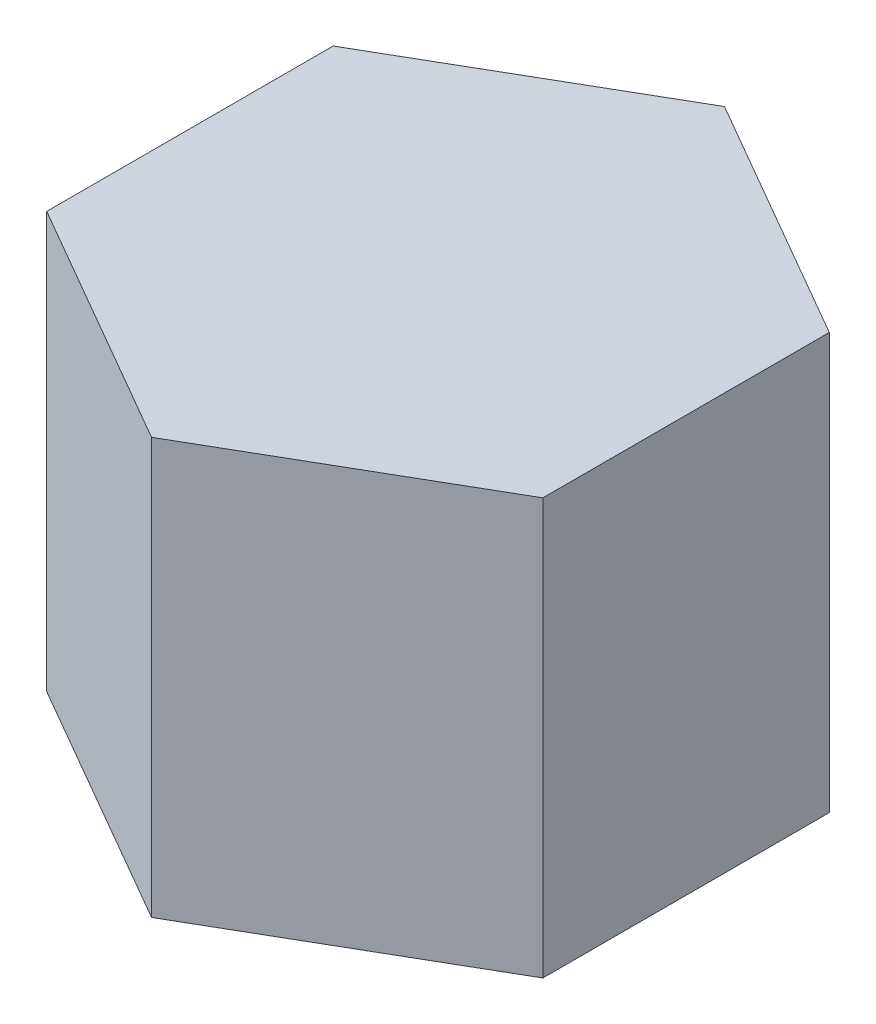
ISO-10303-21;
HEADER;
FILE_DESCRIPTION(('STEP AP214'),'2;1');
FILE_NAME('part.step','',(''),(''),'','','');
FILE_SCHEMA(('AUTOMOTIVE_DESIGN { 1 0 10303 214 1 1 1 1 }'));
ENDSEC;
DATA;
#1=APPLICATION_CONTEXT('core data for automotive mechanical design processes');
#2=APPLICATION_PROTOCOL_DEFINITION('international standard','automotive_design',2000,#1);
#3=PRODUCT_CONTEXT('',#1,'mechanical');
#4=PRODUCT('Part','Part','',(#3));
#5=PRODUCT_RELATED_PRODUCT_CATEGORY('part','',(#4));
#6=PRODUCT_DEFINITION_FORMATION('','',#4);
#7=PRODUCT_DEFINITION_CONTEXT('part definition',#1,'design');
#8=PRODUCT_DEFINITION('design','',#6,#7);
#9=PRODUCT_DEFINITION_SHAPE('','',#8);
#10=(LENGTH_UNIT() NAMED_UNIT(*) SI_UNIT(.MILLI.,.METRE.));
#11=(NAMED_UNIT(*) PLANE_ANGLE_UNIT() SI_UNIT($,.RADIAN.));
#12=(NAMED_UNIT(*) SI_UNIT($,.STERADIAN.) SOLID_ANGLE_UNIT());
#13=UNCERTAINTY_MEASURE_WITH_UNIT(LENGTH_MEASURE(1.E-05),#10,'distance_accuracy_value','');
#14=(GEOMETRIC_REPRESENTATION_CONTEXT(3) GLOBAL_UNCERTAINTY_ASSIGNED_CONTEXT((#13)) GLOBAL_UNIT_ASSIGNED_CONTEXT((#10,
#11,#12)) REPRESENTATION_CONTEXT('',''));
#15=CARTESIAN_POINT('',(0.,0.,0.));
#16=DIRECTION('',(0.,0.,1.));
#17=DIRECTION('',(1.,0.,0.));
#18=AXIS2_PLACEMENT_3D('',#15,#16,#17);
#19=CARTESIAN_POINT('',(208.142660308706,-148.537700895744,292.372996624279));
#20=DIRECTION('',(-0.499999999999909,0.,-0.866025403784491));
#21=DIRECTION('',(-0.866025403784491,0.,0.499999999999909));
#22=AXIS2_PLACEMENT_3D('',#19,#20,#21);
#23=PLANE('',#22);
#24=CARTESIAN_POINT('',(207.839551417382,-149.045793579175,292.547996624279));
#25=DIRECTION('',(0.866025403784491,0.,-0.499999999999909));
#26=VECTOR('',#25,1.);
#27=LINE('',#24,#26);
#28=CARTESIAN_POINT('',(207.839551417382,-149.045793579175,292.547996624279));
#29=VERTEX_POINT('',#28);
#30=CARTESIAN_POINT('',(208.142660308706,-149.045793579175,292.372996624279));
#31=VERTEX_POINT('',#30);
#32=EDGE_CURVE('E170',#29,#31,#27,.T.);
#33=ORIENTED_EDGE('',*,*,#32,.T.);
#34=CARTESIAN_POINT('',(208.142660308706,-148.537700895744,292.372996624279));
#35=DIRECTION('',(0.,-1.,0.));
#36=VECTOR('',#35,1.);
#37=LINE('',#34,#36);
#38=CARTESIAN_POINT('',(208.142660308706,-148.537700895744,292.372996624279));
#39=VERTEX_POINT('',#38);
#40=EDGE_CURVE('E35',#39,#31,#37,.T.);
#41=ORIENTED_EDGE('',*,*,#40,.F.);
#42=CARTESIAN_POINT('',(207.839551417382,-148.537700895744,292.547996624279));
#43=DIRECTION('',(0.866025403784491,0.,-0.499999999999909));
#44=VECTOR('',#43,1.);
#45=LINE('',#42,#44);
#46=CARTESIAN_POINT('',(207.839551417382,-148.537700895744,292.547996624279));
#47=VERTEX_POINT('',#46);
#48=EDGE_CURVE('E159',#47,#39,#45,.T.);
#49=ORIENTED_EDGE('',*,*,#48,.F.);
#50=CARTESIAN_POINT('',(207.839551417382,-148.537700895744,292.547996624279));
#51=DIRECTION('',(0.,-1.,0.));
#52=VECTOR('',#51,1.);
#53=LINE('',#50,#52);
#54=EDGE_CURVE('E10',#47,#29,#53,.T.);
#55=ORIENTED_EDGE('',*,*,#54,.T.);
#56=EDGE_LOOP('',(#33,#41,#49,#55));
#57=FACE_BOUND('',#56,.T.);
#58=ADVANCED_FACE('F16',(#57),#23,.F.);
#59=CARTESIAN_POINT('',(207.839551417382,-148.537700895744,292.547996624279));
#60=DIRECTION('',(0.500000000000062,0.,-0.866025403784403));
#61=DIRECTION('',(-0.866025403784403,0.,-0.500000000000062));
#62=AXIS2_PLACEMENT_3D('',#59,#60,#61);
#63=PLANE('',#62);
#64=CARTESIAN_POINT('',(207.536442526057,-149.045793579175,292.372996624279));
#65=DIRECTION('',(0.866025403784403,0.,0.500000000000062));
#66=VECTOR('',#65,1.);
#67=LINE('',#64,#66);
#68=CARTESIAN_POINT('',(207.536442526057,-149.045793579175,292.372996624279));
#69=VERTEX_POINT('',#68);
#70=EDGE_CURVE('E167',#69,#29,#67,.T.);
#71=ORIENTED_EDGE('',*,*,#70,.T.);
#72=ORIENTED_EDGE('',*,*,#54,.F.);
#73=CARTESIAN_POINT('',(207.536442526057,-148.537700895744,292.372996624279));
#74=DIRECTION('',(0.866025403784403,0.,0.500000000000062));
#75=VECTOR('',#74,1.);
#76=LINE('',#73,#75);
#77=CARTESIAN_POINT('',(207.536442526057,-148.537700895744,292.372996624279));
#78=VERTEX_POINT('',#77);
#79=EDGE_CURVE('E156',#78,#47,#76,.T.);
#80=ORIENTED_EDGE('',*,*,#79,.F.);
#81=CARTESIAN_POINT('',(207.536442526057,-148.537700895744,292.372996624279));
#82=DIRECTION('',(0.,-1.,0.));
#83=VECTOR('',#82,1.);
#84=LINE('',#81,#83);
#85=EDGE_CURVE('E27',#78,#69,#84,.T.);
#86=ORIENTED_EDGE('',*,*,#85,.T.);
#87=EDGE_LOOP('',(#71,#72,#80,#86));
#88=FACE_BOUND('',#87,.T.);
#89=ADVANCED_FACE('F189',(#88),#63,.F.);
#90=CARTESIAN_POINT('',(207.536442526057,-148.537700895744,290.831971220494));
#91=DIRECTION('',(1.,0.,0.));
#92=DIRECTION('',(0.,1.,0.));
#93=AXIS2_PLACEMENT_3D('',#90,#91,#92);
#94=PLANE('',#93);
#95=CARTESIAN_POINT('',(207.536442526057,-149.045793579175,292.022996624279));
#96=DIRECTION('',(0.,0.,1.));
#97=VECTOR('',#96,1.);
#98=LINE('',#95,#97);
#99=CARTESIAN_POINT('',(207.536442526057,-149.045793579175,292.022996624279));
#100=VERTEX_POINT('',#99);
#101=EDGE_CURVE('E163',#100,#69,#98,.T.);
#102=ORIENTED_EDGE('',*,*,#101,.T.);
#103=ORIENTED_EDGE('',*,*,#85,.F.);
#104=CARTESIAN_POINT('',(207.536442526057,-148.537700895744,292.022996624279));
#105=DIRECTION('',(0.,0.,1.));
#106=VECTOR('',#105,1.);
#107=LINE('',#104,#106);
#108=CARTESIAN_POINT('',(207.536442526057,-148.537700895744,292.022996624279));
#109=VERTEX_POINT('',#108);
#110=EDGE_CURVE('E106',#109,#78,#107,.T.);
#111=ORIENTED_EDGE('',*,*,#110,.F.);
#112=CARTESIAN_POINT('',(207.536442526057,-148.537700895744,292.022996624279));
#113=DIRECTION('',(0.,-1.,0.));
#114=VECTOR('',#113,1.);
#115=LINE('',#112,#114);
#116=EDGE_CURVE('E94',#109,#100,#115,.T.);
#117=ORIENTED_EDGE('',*,*,#116,.T.);
#118=EDGE_LOOP('',(#102,#103,#111,#117));
#119=FACE_BOUND('',#118,.T.);
#120=ADVANCED_FACE('F198',(#119),#94,.F.);
#121=CARTESIAN_POINT('',(207.536442526057,-148.537700895744,292.022996624279));
#122=DIRECTION('',(0.499999999999943,0.,0.866025403784472));
#123=DIRECTION('',(0.866025403784472,0.,-0.499999999999943));
#124=AXIS2_PLACEMENT_3D('',#121,#122,#123);
#125=PLANE('',#124);
#126=CARTESIAN_POINT('',(207.839551417382,-149.045793579175,291.847996624279));
#127=DIRECTION('',(-0.866025403784471,0.,0.499999999999943));
#128=VECTOR('',#127,1.);
#129=LINE('',#126,#128);
#130=CARTESIAN_POINT('',(207.839551417382,-149.045793579175,291.847996624279));
#131=VERTEX_POINT('',#130);
#132=EDGE_CURVE('E162',#131,#100,#129,.T.);
#133=ORIENTED_EDGE('',*,*,#132,.T.);
#134=ORIENTED_EDGE('',*,*,#116,.F.);
#135=CARTESIAN_POINT('',(207.839551417382,-148.537700895744,291.847996624279));
#136=DIRECTION('',(-0.866025403784471,0.,0.499999999999943));
#137=VECTOR('',#136,1.);
#138=LINE('',#135,#137);
#139=CARTESIAN_POINT('',(207.839551417382,-148.537700895744,291.847996624279));
#140=VERTEX_POINT('',#139);
#141=EDGE_CURVE('E98',#140,#109,#138,.T.);
#142=ORIENTED_EDGE('',*,*,#141,.F.);
#143=CARTESIAN_POINT('',(207.839551417382,-148.537700895744,291.847996624279));
#144=DIRECTION('',(0.,-1.,0.));
#145=VECTOR('',#144,1.);
#146=LINE('',#143,#145);
#147=EDGE_CURVE('E79',#140,#131,#146,.T.);
#148=ORIENTED_EDGE('',*,*,#147,.T.);
#149=EDGE_LOOP('',(#133,#134,#142,#148));
#150=FACE_BOUND('',#149,.T.);
#151=ADVANCED_FACE('F100',(#150),#125,.F.);
#152=CARTESIAN_POINT('',(207.839551417382,-148.537700895744,291.847996624279));
#153=DIRECTION('',(-0.500000000000062,0.,0.866025403784403));
#154=DIRECTION('',(0.866025403784403,0.,0.500000000000062));
#155=AXIS2_PLACEMENT_3D('',#152,#153,#154);
#156=PLANE('',#155);
#157=CARTESIAN_POINT('',(208.142660308706,-149.045793579175,292.022996624279));
#158=DIRECTION('',(-0.866025403784403,0.,-0.500000000000062));
#159=VECTOR('',#158,1.);
#160=LINE('',#157,#159);
#161=CARTESIAN_POINT('',(208.142660308706,-149.045793579175,292.022996624279));
#162=VERTEX_POINT('',#161);
#163=EDGE_CURVE('E88',#162,#131,#160,.T.);
#164=ORIENTED_EDGE('',*,*,#163,.T.);
#165=ORIENTED_EDGE('',*,*,#147,.F.);
#166=CARTESIAN_POINT('',(208.142660308706,-148.537700895744,292.022996624279));
#167=DIRECTION('',(-0.866025403784403,0.,-0.500000000000062));
#168=VECTOR('',#167,1.);
#169=LINE('',#166,#168);
#170=CARTESIAN_POINT('',(208.142660308706,-148.537700895744,292.022996624279));
#171=VERTEX_POINT('',#170);
#172=EDGE_CURVE('E84',#171,#140,#169,.T.);
#173=ORIENTED_EDGE('',*,*,#172,.F.);
#174=CARTESIAN_POINT('',(208.142660308706,-148.537700895744,292.022996624279));
#175=DIRECTION('',(0.,-1.,0.));
#176=VECTOR('',#175,1.);
#177=LINE('',#174,#176);
#178=EDGE_CURVE('E58',#171,#162,#177,.T.);
#179=ORIENTED_EDGE('',*,*,#178,.T.);
#180=EDGE_LOOP('',(#164,#165,#173,#179));
#181=FACE_BOUND('',#180,.T.);
#182=ADVANCED_FACE('F82',(#181),#156,.F.);
#183=CARTESIAN_POINT('',(208.142660308706,-148.537700895744,290.831971220494));
#184=DIRECTION('',(-1.,0.,0.));
#185=DIRECTION('',(0.,-1.,0.));
#186=AXIS2_PLACEMENT_3D('',#183,#184,#185);
#187=PLANE('',#186);
#188=CARTESIAN_POINT('',(208.142660308706,-149.045793579175,292.372996624279));
#189=DIRECTION('',(0.,0.,-1.));
#190=VECTOR('',#189,1.);
#191=LINE('',#188,#190);
#192=EDGE_CURVE('E160',#31,#162,#191,.T.);
#193=ORIENTED_EDGE('',*,*,#192,.T.);
#194=ORIENTED_EDGE('',*,*,#178,.F.);
#195=CARTESIAN_POINT('',(208.142660308706,-148.537700895744,292.372996624279));
#196=DIRECTION('',(0.,0.,-1.));
#197=VECTOR('',#196,1.);
#198=LINE('',#195,#197);
#199=EDGE_CURVE('E112',#39,#171,#198,.T.);
#200=ORIENTED_EDGE('',*,*,#199,.F.);
#201=ORIENTED_EDGE('',*,*,#40,.T.);
#202=EDGE_LOOP('',(#193,#194,#200,#201));
#203=FACE_BOUND('',#202,.T.);
#204=ADVANCED_FACE('F131',(#203),#187,.F.);
#205=CARTESIAN_POINT('',(206.339551417382,-148.537700895744,290.831971220494));
#206=DIRECTION('',(0.,-1.,0.));
#207=DIRECTION('',(1.,0.,0.));
#208=AXIS2_PLACEMENT_3D('',#205,#206,#207);
#209=PLANE('',#208);
#210=ORIENTED_EDGE('',*,*,#48,.T.);
#211=ORIENTED_EDGE('',*,*,#199,.T.);
#212=ORIENTED_EDGE('',*,*,#172,.T.);
#213=ORIENTED_EDGE('',*,*,#141,.T.);
#214=ORIENTED_EDGE('',*,*,#110,.T.);
#215=ORIENTED_EDGE('',*,*,#79,.T.);
#216=EDGE_LOOP('',(#210,#211,#212,#213,#214,#215));
#217=FACE_BOUND('',#216,.T.);
#218=ADVANCED_FACE('F111',(#217),#209,.F.);
#219=CARTESIAN_POINT('',(206.339551417382,-149.045793579175,290.831971220494));
#220=DIRECTION('',(0.,-1.,0.));
#221=DIRECTION('',(1.,0.,0.));
#222=AXIS2_PLACEMENT_3D('',#219,#220,#221);
#223=PLANE('',#222);
#224=ORIENTED_EDGE('',*,*,#32,.F.);
#225=ORIENTED_EDGE('',*,*,#70,.F.);
#226=ORIENTED_EDGE('',*,*,#101,.F.);
#227=ORIENTED_EDGE('',*,*,#132,.F.);
#228=ORIENTED_EDGE('',*,*,#163,.F.);
#229=ORIENTED_EDGE('',*,*,#192,.F.);
#230=EDGE_LOOP('',(#224,#225,#226,#227,#228,#229));
#231=FACE_BOUND('',#230,.T.);
#232=ADVANCED_FACE('F130',(#231),#223,.T.);
#233=CLOSED_SHELL('',(#58,#89,#120,#151,#182,#204,#218,#232));
#234=MANIFOLD_SOLID_BREP('B1',#233);
#235=ADVANCED_BREP_SHAPE_REPRESENTATION('',(#18,#234),#14);
#236=SHAPE_DEFINITION_REPRESENTATION(#9,#235);
ENDSEC;
END-ISO-10303-21;
